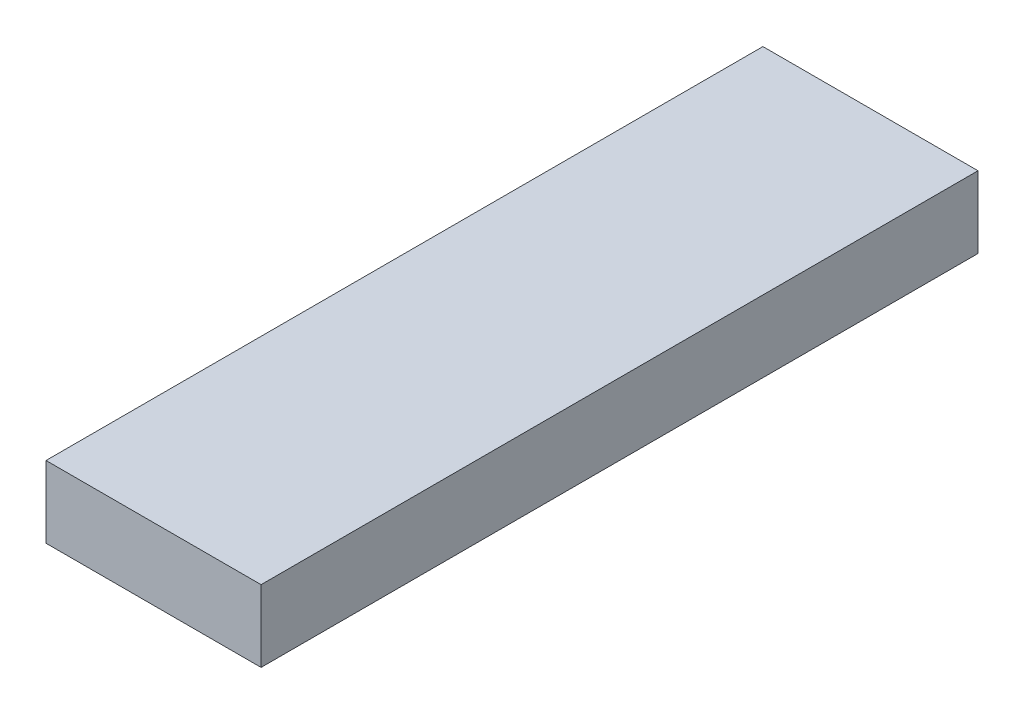
ISO-10303-21;
HEADER;
FILE_DESCRIPTION(('STEP AP214'),'2;1');
FILE_NAME('part.step','',(''),(''),'','','');
FILE_SCHEMA(('AUTOMOTIVE_DESIGN { 1 0 10303 214 1 1 1 1 }'));
ENDSEC;
DATA;
#1=APPLICATION_CONTEXT('core data for automotive mechanical design processes');
#2=APPLICATION_PROTOCOL_DEFINITION('international standard','automotive_design',2000,#1);
#3=PRODUCT_CONTEXT('',#1,'mechanical');
#4=PRODUCT('Part','Part','',(#3));
#5=PRODUCT_RELATED_PRODUCT_CATEGORY('part','',(#4));
#6=PRODUCT_DEFINITION_FORMATION('','',#4);
#7=PRODUCT_DEFINITION_CONTEXT('part definition',#1,'design');
#8=PRODUCT_DEFINITION('design','',#6,#7);
#9=PRODUCT_DEFINITION_SHAPE('','',#8);
#10=(LENGTH_UNIT() NAMED_UNIT(*) SI_UNIT(.MILLI.,.METRE.));
#11=(NAMED_UNIT(*) PLANE_ANGLE_UNIT() SI_UNIT($,.RADIAN.));
#12=(NAMED_UNIT(*) SI_UNIT($,.STERADIAN.) SOLID_ANGLE_UNIT());
#13=UNCERTAINTY_MEASURE_WITH_UNIT(LENGTH_MEASURE(1.E-05),#10,'distance_accuracy_value','');
#14=(GEOMETRIC_REPRESENTATION_CONTEXT(3) GLOBAL_UNCERTAINTY_ASSIGNED_CONTEXT((#13)) GLOBAL_UNIT_ASSIGNED_CONTEXT((#10,
#11,#12)) REPRESENTATION_CONTEXT('',''));
#15=CARTESIAN_POINT('',(0.,0.,0.));
#16=DIRECTION('',(0.,0.,1.));
#17=DIRECTION('',(1.,0.,0.));
#18=AXIS2_PLACEMENT_3D('',#15,#16,#17);
#19=CARTESIAN_POINT('',(0.,0.,30.));
#20=DIRECTION('',(1.,0.,0.));
#21=DIRECTION('',(0.,0.,-1.));
#22=AXIS2_PLACEMENT_3D('',#19,#20,#21);
#23=PLANE('',#22);
#24=DIRECTION('',(0.,-1.,0.));
#25=VECTOR('',#24,1.);
#26=CARTESIAN_POINT('',(0.,0.,0.));
#27=LINE('',#26,#25);
#28=CARTESIAN_POINT('',(0.,3.,0.));
#29=VERTEX_POINT('',#28);
#30=CARTESIAN_POINT('',(0.,0.,0.));
#31=VERTEX_POINT('',#30);
#32=EDGE_CURVE('E109',#29,#31,#27,.T.);
#33=ORIENTED_EDGE('',*,*,#32,.T.);
#34=DIRECTION('',(0.,0.,-1.));
#35=VECTOR('',#34,1.);
#36=CARTESIAN_POINT('',(0.,0.,30.));
#37=LINE('',#36,#35);
#38=CARTESIAN_POINT('',(0.,0.,30.));
#39=VERTEX_POINT('',#38);
#40=EDGE_CURVE('E11',#39,#31,#37,.T.);
#41=ORIENTED_EDGE('',*,*,#40,.F.);
#42=DIRECTION('',(0.,-1.,0.));
#43=VECTOR('',#42,1.);
#44=CARTESIAN_POINT('',(0.,0.,30.));
#45=LINE('',#44,#43);
#46=CARTESIAN_POINT('',(0.,3.,30.));
#47=VERTEX_POINT('',#46);
#48=EDGE_CURVE('E93',#47,#39,#45,.T.);
#49=ORIENTED_EDGE('',*,*,#48,.F.);
#50=DIRECTION('',(0.,0.,-1.));
#51=VECTOR('',#50,1.);
#52=CARTESIAN_POINT('',(0.,3.,30.));
#53=LINE('',#52,#51);
#54=EDGE_CURVE('E105',#47,#29,#53,.T.);
#55=ORIENTED_EDGE('',*,*,#54,.T.);
#56=EDGE_LOOP('',(#33,#41,#49,#55));
#57=FACE_BOUND('',#56,.T.);
#58=ADVANCED_FACE('F41',(#57),#23,.F.);
#59=CARTESIAN_POINT('',(0.,0.,30.));
#60=DIRECTION('',(0.,1.,0.));
#61=DIRECTION('',(0.,0.,1.));
#62=AXIS2_PLACEMENT_3D('',#59,#60,#61);
#63=PLANE('',#62);
#64=DIRECTION('',(1.,0.,0.));
#65=VECTOR('',#64,1.);
#66=CARTESIAN_POINT('',(0.,0.,0.));
#67=LINE('',#66,#65);
#68=CARTESIAN_POINT('',(9.,0.,0.));
#69=VERTEX_POINT('',#68);
#70=EDGE_CURVE('E98',#31,#69,#67,.T.);
#71=ORIENTED_EDGE('',*,*,#70,.T.);
#72=DIRECTION('',(0.,0.,-1.));
#73=VECTOR('',#72,1.);
#74=CARTESIAN_POINT('',(9.,0.,30.));
#75=LINE('',#74,#73);
#76=CARTESIAN_POINT('',(9.,0.,30.));
#77=VERTEX_POINT('',#76);
#78=EDGE_CURVE('E50',#77,#69,#75,.T.);
#79=ORIENTED_EDGE('',*,*,#78,.F.);
#80=DIRECTION('',(1.,0.,0.));
#81=VECTOR('',#80,1.);
#82=CARTESIAN_POINT('',(0.,0.,30.));
#83=LINE('',#82,#81);
#84=EDGE_CURVE('E88',#39,#77,#83,.T.);
#85=ORIENTED_EDGE('',*,*,#84,.F.);
#86=ORIENTED_EDGE('',*,*,#40,.T.);
#87=EDGE_LOOP('',(#71,#79,#85,#86));
#88=FACE_BOUND('',#87,.T.);
#89=ADVANCED_FACE('F97',(#88),#63,.F.);
#90=CARTESIAN_POINT('',(9.,0.,30.));
#91=DIRECTION('',(-1.,0.,0.));
#92=DIRECTION('',(0.,0.,1.));
#93=AXIS2_PLACEMENT_3D('',#90,#91,#92);
#94=PLANE('',#93);
#95=DIRECTION('',(0.,1.,0.));
#96=VECTOR('',#95,1.);
#97=CARTESIAN_POINT('',(9.,0.,0.));
#98=LINE('',#97,#96);
#99=CARTESIAN_POINT('',(9.,3.,0.));
#100=VERTEX_POINT('',#99);
#101=EDGE_CURVE('E75',#69,#100,#98,.T.);
#102=ORIENTED_EDGE('',*,*,#101,.T.);
#103=DIRECTION('',(0.,0.,-1.));
#104=VECTOR('',#103,1.);
#105=CARTESIAN_POINT('',(9.,3.,30.));
#106=LINE('',#105,#104);
#107=CARTESIAN_POINT('',(9.,3.,30.));
#108=VERTEX_POINT('',#107);
#109=EDGE_CURVE('E100',#108,#100,#106,.T.);
#110=ORIENTED_EDGE('',*,*,#109,.F.);
#111=DIRECTION('',(0.,1.,0.));
#112=VECTOR('',#111,1.);
#113=CARTESIAN_POINT('',(9.,0.,30.));
#114=LINE('',#113,#112);
#115=EDGE_CURVE('E91',#77,#108,#114,.T.);
#116=ORIENTED_EDGE('',*,*,#115,.F.);
#117=ORIENTED_EDGE('',*,*,#78,.T.);
#118=EDGE_LOOP('',(#102,#110,#116,#117));
#119=FACE_BOUND('',#118,.T.);
#120=ADVANCED_FACE('F101',(#119),#94,.F.);
#121=CARTESIAN_POINT('',(0.,3.,30.));
#122=DIRECTION('',(0.,-1.,0.));
#123=DIRECTION('',(0.,0.,-1.));
#124=AXIS2_PLACEMENT_3D('',#121,#122,#123);
#125=PLANE('',#124);
#126=DIRECTION('',(-1.,0.,0.));
#127=VECTOR('',#126,1.);
#128=CARTESIAN_POINT('',(0.,3.,0.));
#129=LINE('',#128,#127);
#130=EDGE_CURVE('E81',#100,#29,#129,.T.);
#131=ORIENTED_EDGE('',*,*,#130,.T.);
#132=ORIENTED_EDGE('',*,*,#54,.F.);
#133=DIRECTION('',(-1.,0.,0.));
#134=VECTOR('',#133,1.);
#135=CARTESIAN_POINT('',(0.,3.,30.));
#136=LINE('',#135,#134);
#137=EDGE_CURVE('E58',#108,#47,#136,.T.);
#138=ORIENTED_EDGE('',*,*,#137,.F.);
#139=ORIENTED_EDGE('',*,*,#109,.T.);
#140=EDGE_LOOP('',(#131,#132,#138,#139));
#141=FACE_BOUND('',#140,.T.);
#142=ADVANCED_FACE('F122',(#141),#125,.F.);
#143=CARTESIAN_POINT('',(0.,0.,30.));
#144=DIRECTION('',(0.,0.,-1.));
#145=DIRECTION('',(-1.,0.,0.));
#146=AXIS2_PLACEMENT_3D('',#143,#144,#145);
#147=PLANE('',#146);
#148=ORIENTED_EDGE('',*,*,#48,.T.);
#149=ORIENTED_EDGE('',*,*,#84,.T.);
#150=ORIENTED_EDGE('',*,*,#115,.T.);
#151=ORIENTED_EDGE('',*,*,#137,.T.);
#152=EDGE_LOOP('',(#148,#149,#150,#151));
#153=FACE_BOUND('',#152,.T.);
#154=ADVANCED_FACE('F89',(#153),#147,.F.);
#155=CARTESIAN_POINT('',(0.,0.,0.));
#156=DIRECTION('',(0.,0.,-1.));
#157=DIRECTION('',(-1.,0.,0.));
#158=AXIS2_PLACEMENT_3D('',#155,#156,#157);
#159=PLANE('',#158);
#160=ORIENTED_EDGE('',*,*,#32,.F.);
#161=ORIENTED_EDGE('',*,*,#130,.F.);
#162=ORIENTED_EDGE('',*,*,#101,.F.);
#163=ORIENTED_EDGE('',*,*,#70,.F.);
#164=EDGE_LOOP('',(#160,#161,#162,#163));
#165=FACE_BOUND('',#164,.T.);
#166=ADVANCED_FACE('F125',(#165),#159,.T.);
#167=CLOSED_SHELL('',(#58,#89,#120,#142,#154,#166));
#168=MANIFOLD_SOLID_BREP('B2',#167);
#169=ADVANCED_BREP_SHAPE_REPRESENTATION('',(#18,#168),#14);
#170=SHAPE_DEFINITION_REPRESENTATION(#9,#169);
ENDSEC;
END-ISO-10303-21;
